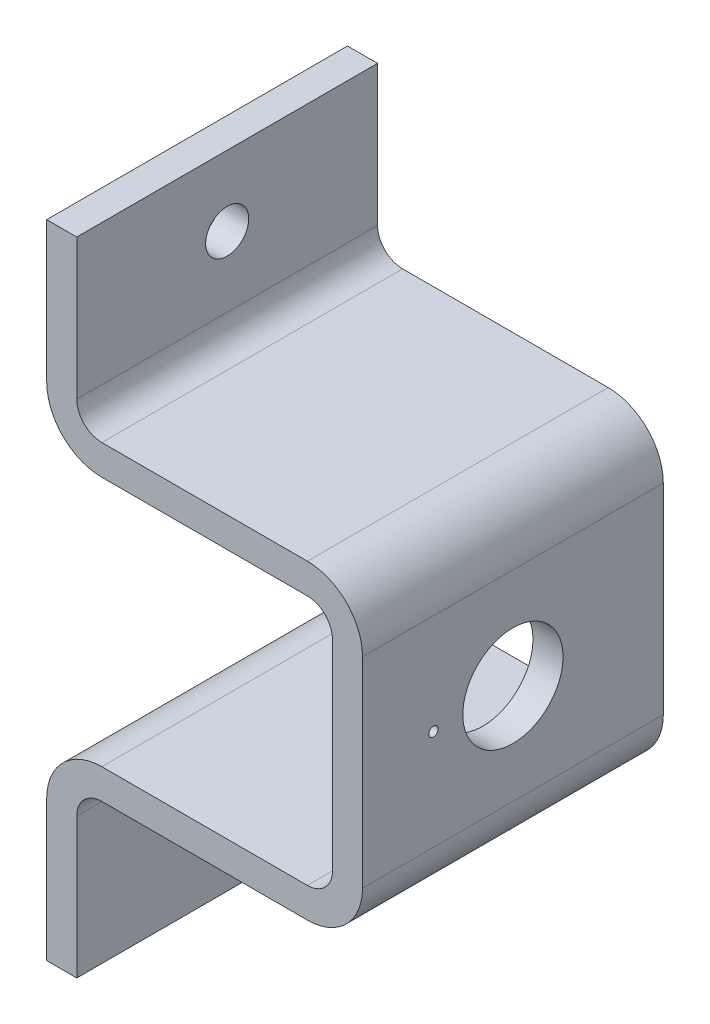
ISO-10303-21;
HEADER;
FILE_DESCRIPTION(('STEP AP214'),'2;1');
FILE_NAME('part.step','',(''),(''),'','','');
FILE_SCHEMA(('AUTOMOTIVE_DESIGN { 1 0 10303 214 1 1 1 1 }'));
ENDSEC;
DATA;
#1=APPLICATION_CONTEXT('core data for automotive mechanical design processes');
#2=APPLICATION_PROTOCOL_DEFINITION('international standard','automotive_design',2000,#1);
#3=PRODUCT_CONTEXT('',#1,'mechanical');
#4=PRODUCT('Part','Part','',(#3));
#5=PRODUCT_RELATED_PRODUCT_CATEGORY('part','',(#4));
#6=PRODUCT_DEFINITION_FORMATION('','',#4);
#7=PRODUCT_DEFINITION_CONTEXT('part definition',#1,'design');
#8=PRODUCT_DEFINITION('design','',#6,#7);
#9=PRODUCT_DEFINITION_SHAPE('','',#8);
#10=(LENGTH_UNIT() NAMED_UNIT(*) SI_UNIT(.MILLI.,.METRE.));
#11=(NAMED_UNIT(*) PLANE_ANGLE_UNIT() SI_UNIT($,.RADIAN.));
#12=(NAMED_UNIT(*) SI_UNIT($,.STERADIAN.) SOLID_ANGLE_UNIT());
#13=UNCERTAINTY_MEASURE_WITH_UNIT(LENGTH_MEASURE(1.E-05),#10,'distance_accuracy_value','');
#14=(GEOMETRIC_REPRESENTATION_CONTEXT(3) GLOBAL_UNCERTAINTY_ASSIGNED_CONTEXT((#13)) GLOBAL_UNIT_ASSIGNED_CONTEXT((#10,
#11,#12)) REPRESENTATION_CONTEXT('',''));
#15=CARTESIAN_POINT('',(0.,0.,0.));
#16=DIRECTION('',(0.,0.,1.));
#17=DIRECTION('',(1.,0.,0.));
#18=AXIS2_PLACEMENT_3D('',#15,#16,#17);
#19=CARTESIAN_POINT('',(3.,0.,30.));
#20=DIRECTION('',(0.,1.,0.));
#21=DIRECTION('',(0.,0.,1.));
#22=AXIS2_PLACEMENT_3D('',#19,#20,#21);
#23=PLANE('',#22);
#24=DIRECTION('',(1.,0.,0.));
#25=VECTOR('',#24,1.);
#26=CARTESIAN_POINT('',(3.,0.,0.));
#27=LINE('',#26,#25);
#28=CARTESIAN_POINT('',(0.,0.,0.));
#29=VERTEX_POINT('',#28);
#30=CARTESIAN_POINT('',(3.,0.,0.));
#31=VERTEX_POINT('',#30);
#32=EDGE_CURVE('E206',#29,#31,#27,.T.);
#33=ORIENTED_EDGE('',*,*,#32,.T.);
#34=DIRECTION('',(0.,0.,-1.));
#35=VECTOR('',#34,1.);
#36=CARTESIAN_POINT('',(3.,0.,30.));
#37=LINE('',#36,#35);
#38=CARTESIAN_POINT('',(3.,0.,30.));
#39=VERTEX_POINT('',#38);
#40=EDGE_CURVE('E11',#39,#31,#37,.T.);
#41=ORIENTED_EDGE('',*,*,#40,.F.);
#42=DIRECTION('',(1.,0.,0.));
#43=VECTOR('',#42,1.);
#44=CARTESIAN_POINT('',(3.,0.,30.));
#45=LINE('',#44,#43);
#46=CARTESIAN_POINT('',(0.,0.,30.));
#47=VERTEX_POINT('',#46);
#48=EDGE_CURVE('E245',#47,#39,#45,.T.);
#49=ORIENTED_EDGE('',*,*,#48,.F.);
#50=DIRECTION('',(0.,0.,-1.));
#51=VECTOR('',#50,1.);
#52=CARTESIAN_POINT('',(0.,0.,30.));
#53=LINE('',#52,#51);
#54=EDGE_CURVE('E202',#47,#29,#53,.T.);
#55=ORIENTED_EDGE('',*,*,#54,.T.);
#56=EDGE_LOOP('',(#33,#41,#49,#55));
#57=FACE_BOUND('',#56,.T.);
#58=ADVANCED_FACE('F36',(#57),#23,.F.);
#59=CARTESIAN_POINT('',(3.,0.,30.));
#60=DIRECTION('',(-1.,0.,0.));
#61=DIRECTION('',(0.,-1.,0.));
#62=AXIS2_PLACEMENT_3D('',#59,#60,#61);
#63=PLANE('',#62);
#64=CARTESIAN_POINT('',(3.,7.,15.));
#65=DIRECTION('',(1.,0.,0.));
#66=DIRECTION('',(0.,0.,-1.));
#67=AXIS2_PLACEMENT_3D('',#64,#65,#66);
#68=CIRCLE('',#67,2.14999999999999);
#69=CARTESIAN_POINT('',(3.,7.,12.85));
#70=VERTEX_POINT('',#69);
#71=EDGE_CURVE('E294',#70,#70,#68,.T.);
#72=ORIENTED_EDGE('',*,*,#71,.F.);
#73=EDGE_LOOP('',(#72));
#74=FACE_BOUND('',#73,.T.);
#75=DIRECTION('',(0.,1.,0.));
#76=VECTOR('',#75,1.);
#77=CARTESIAN_POINT('',(3.,0.,0.));
#78=LINE('',#77,#76);
#79=CARTESIAN_POINT('',(3.00000000000006,14.,0.));
#80=VERTEX_POINT('',#79);
#81=EDGE_CURVE('E209',#31,#80,#78,.T.);
#82=ORIENTED_EDGE('',*,*,#81,.T.);
#83=DIRECTION('',(0.,0.,-1.));
#84=VECTOR('',#83,1.);
#85=CARTESIAN_POINT('',(3.00000000000006,14.,30.));
#86=LINE('',#85,#84);
#87=CARTESIAN_POINT('',(3.00000000000006,14.,30.));
#88=VERTEX_POINT('',#87);
#89=EDGE_CURVE('E45',#88,#80,#86,.T.);
#90=ORIENTED_EDGE('',*,*,#89,.F.);
#91=DIRECTION('',(0.,1.,0.));
#92=VECTOR('',#91,1.);
#93=CARTESIAN_POINT('',(3.,0.,30.));
#94=LINE('',#93,#92);
#95=EDGE_CURVE('E133',#39,#88,#94,.T.);
#96=ORIENTED_EDGE('',*,*,#95,.F.);
#97=ORIENTED_EDGE('',*,*,#40,.T.);
#98=EDGE_LOOP('',(#82,#90,#96,#97));
#99=FACE_BOUND('',#98,.T.);
#100=ADVANCED_FACE('F370',(#74,#99),#63,.F.);
#101=CARTESIAN_POINT('',(5.50000000000006,14.,30.));
#102=DIRECTION('',(0.,0.,-1.));
#103=DIRECTION('',(-1.,0.,0.));
#104=AXIS2_PLACEMENT_3D('',#101,#102,#103);
#105=CYLINDRICAL_SURFACE('',#104,2.5);
#106=CARTESIAN_POINT('',(5.50000000000006,14.,0.));
#107=DIRECTION('',(0.,0.,-1.));
#108=DIRECTION('',(-1.,0.,0.));
#109=AXIS2_PLACEMENT_3D('',#106,#107,#108);
#110=CIRCLE('',#109,2.5);
#111=CARTESIAN_POINT('',(5.50000000000006,16.5,0.));
#112=VERTEX_POINT('',#111);
#113=EDGE_CURVE('E212',#80,#112,#110,.T.);
#114=ORIENTED_EDGE('',*,*,#113,.T.);
#115=DIRECTION('',(0.,0.,-1.));
#116=VECTOR('',#115,1.);
#117=CARTESIAN_POINT('',(5.50000000000006,16.5,30.));
#118=LINE('',#117,#116);
#119=CARTESIAN_POINT('',(5.50000000000006,16.5,30.));
#120=VERTEX_POINT('',#119);
#121=EDGE_CURVE('E288',#120,#112,#118,.T.);
#122=ORIENTED_EDGE('',*,*,#121,.F.);
#123=CARTESIAN_POINT('',(5.50000000000006,14.,30.));
#124=DIRECTION('',(0.,0.,-1.));
#125=DIRECTION('',(-1.,0.,0.));
#126=AXIS2_PLACEMENT_3D('',#123,#124,#125);
#127=CIRCLE('',#126,2.5);
#128=EDGE_CURVE('E314',#88,#120,#127,.T.);
#129=ORIENTED_EDGE('',*,*,#128,.F.);
#130=ORIENTED_EDGE('',*,*,#89,.T.);
#131=EDGE_LOOP('',(#114,#122,#129,#130));
#132=FACE_BOUND('',#131,.T.);
#133=ADVANCED_FACE('F374',(#132),#105,.F.);
#134=CARTESIAN_POINT('',(5.50000000000006,16.5,30.));
#135=DIRECTION('',(0.,1.,0.));
#136=DIRECTION('',(-1.,0.,0.));
#137=AXIS2_PLACEMENT_3D('',#134,#135,#136);
#138=PLANE('',#137);
#139=DIRECTION('',(1.,0.,0.));
#140=VECTOR('',#139,1.);
#141=CARTESIAN_POINT('',(5.50000000000006,16.5,0.));
#142=LINE('',#141,#140);
#143=CARTESIAN_POINT('',(26.0000000000001,16.5,0.));
#144=VERTEX_POINT('',#143);
#145=EDGE_CURVE('E214',#112,#144,#142,.T.);
#146=ORIENTED_EDGE('',*,*,#145,.T.);
#147=DIRECTION('',(0.,0.,-1.));
#148=VECTOR('',#147,1.);
#149=CARTESIAN_POINT('',(26.0000000000001,16.5,30.));
#150=LINE('',#149,#148);
#151=CARTESIAN_POINT('',(26.0000000000001,16.5,30.));
#152=VERTEX_POINT('',#151);
#153=EDGE_CURVE('E285',#152,#144,#150,.T.);
#154=ORIENTED_EDGE('',*,*,#153,.F.);
#155=DIRECTION('',(1.,0.,0.));
#156=VECTOR('',#155,1.);
#157=CARTESIAN_POINT('',(5.50000000000006,16.5,30.));
#158=LINE('',#157,#156);
#159=EDGE_CURVE('E316',#120,#152,#158,.T.);
#160=ORIENTED_EDGE('',*,*,#159,.F.);
#161=ORIENTED_EDGE('',*,*,#121,.T.);
#162=EDGE_LOOP('',(#146,#154,#160,#161));
#163=FACE_BOUND('',#162,.T.);
#164=ADVANCED_FACE('F379',(#163),#138,.F.);
#165=CARTESIAN_POINT('',(26.0000000000001,22.,30.));
#166=DIRECTION('',(0.,0.,-1.));
#167=DIRECTION('',(-1.,0.,0.));
#168=AXIS2_PLACEMENT_3D('',#165,#166,#167);
#169=CYLINDRICAL_SURFACE('',#168,5.5);
#170=CARTESIAN_POINT('',(26.0000000000001,22.,0.));
#171=DIRECTION('',(0.,0.,1.));
#172=DIRECTION('',(1.,0.,0.));
#173=AXIS2_PLACEMENT_3D('',#170,#171,#172);
#174=CIRCLE('',#173,5.5);
#175=CARTESIAN_POINT('',(31.5000000000001,22.,0.));
#176=VERTEX_POINT('',#175);
#177=EDGE_CURVE('E216',#144,#176,#174,.T.);
#178=ORIENTED_EDGE('',*,*,#177,.T.);
#179=DIRECTION('',(0.,0.,-1.));
#180=VECTOR('',#179,1.);
#181=CARTESIAN_POINT('',(31.5000000000001,22.,30.));
#182=LINE('',#181,#180);
#183=CARTESIAN_POINT('',(31.5000000000001,22.,30.));
#184=VERTEX_POINT('',#183);
#185=EDGE_CURVE('E282',#184,#176,#182,.T.);
#186=ORIENTED_EDGE('',*,*,#185,.F.);
#187=CARTESIAN_POINT('',(26.0000000000001,22.,30.));
#188=DIRECTION('',(0.,0.,1.));
#189=DIRECTION('',(1.,0.,0.));
#190=AXIS2_PLACEMENT_3D('',#187,#188,#189);
#191=CIRCLE('',#190,5.5);
#192=EDGE_CURVE('E318',#152,#184,#191,.T.);
#193=ORIENTED_EDGE('',*,*,#192,.F.);
#194=ORIENTED_EDGE('',*,*,#153,.T.);
#195=EDGE_LOOP('',(#178,#186,#193,#194));
#196=FACE_BOUND('',#195,.T.);
#197=ADVANCED_FACE('F386',(#196),#169,.T.);
#198=CARTESIAN_POINT('',(31.5000000000001,22.,30.));
#199=DIRECTION('',(-1.,0.,0.));
#200=DIRECTION('',(0.,0.,1.));
#201=AXIS2_PLACEMENT_3D('',#198,#199,#200);
#202=PLANE('',#201);
#203=CARTESIAN_POINT('',(31.5000000000001,32.,22.92));
#204=DIRECTION('',(1.,0.,0.));
#205=DIRECTION('',(0.,0.,-1.));
#206=AXIS2_PLACEMENT_3D('',#203,#204,#205);
#207=CIRCLE('',#206,0.475000000000001);
#208=CARTESIAN_POINT('',(31.5000000000001,32.,22.445));
#209=VERTEX_POINT('',#208);
#210=EDGE_CURVE('E545',#209,#209,#207,.T.);
#211=ORIENTED_EDGE('',*,*,#210,.F.);
#212=EDGE_LOOP('',(#211));
#213=FACE_BOUND('',#212,.T.);
#214=CARTESIAN_POINT('',(31.5000000000001,32.,15.));
#215=DIRECTION('',(1.,0.,0.));
#216=DIRECTION('',(0.,0.,-1.));
#217=AXIS2_PLACEMENT_3D('',#214,#215,#216);
#218=CIRCLE('',#217,5.);
#219=CARTESIAN_POINT('',(31.5000000000001,32.,10.));
#220=VERTEX_POINT('',#219);
#221=EDGE_CURVE('E308',#220,#220,#218,.T.);
#222=ORIENTED_EDGE('',*,*,#221,.F.);
#223=EDGE_LOOP('',(#222));
#224=FACE_BOUND('',#223,.T.);
#225=DIRECTION('',(0.,1.,0.));
#226=VECTOR('',#225,1.);
#227=CARTESIAN_POINT('',(31.5000000000001,22.,0.));
#228=LINE('',#227,#226);
#229=CARTESIAN_POINT('',(31.5000000000001,42.,0.));
#230=VERTEX_POINT('',#229);
#231=EDGE_CURVE('E218',#176,#230,#228,.T.);
#232=ORIENTED_EDGE('',*,*,#231,.T.);
#233=DIRECTION('',(0.,0.,-1.));
#234=VECTOR('',#233,1.);
#235=CARTESIAN_POINT('',(31.5000000000001,42.,30.));
#236=LINE('',#235,#234);
#237=CARTESIAN_POINT('',(31.5000000000001,42.,30.));
#238=VERTEX_POINT('',#237);
#239=EDGE_CURVE('E279',#238,#230,#236,.T.);
#240=ORIENTED_EDGE('',*,*,#239,.F.);
#241=DIRECTION('',(0.,1.,0.));
#242=VECTOR('',#241,1.);
#243=CARTESIAN_POINT('',(31.5000000000001,22.,30.));
#244=LINE('',#243,#242);
#245=EDGE_CURVE('E320',#184,#238,#244,.T.);
#246=ORIENTED_EDGE('',*,*,#245,.F.);
#247=ORIENTED_EDGE('',*,*,#185,.T.);
#248=EDGE_LOOP('',(#232,#240,#246,#247));
#249=FACE_BOUND('',#248,.T.);
#250=ADVANCED_FACE('F390',(#213,#224,#249),#202,.F.);
#251=CARTESIAN_POINT('',(26.0000000000001,42.,30.));
#252=DIRECTION('',(0.,0.,-1.));
#253=DIRECTION('',(-1.,0.,0.));
#254=AXIS2_PLACEMENT_3D('',#251,#252,#253);
#255=CYLINDRICAL_SURFACE('',#254,5.5);
#256=CARTESIAN_POINT('',(26.0000000000001,42.,0.));
#257=DIRECTION('',(0.,0.,1.));
#258=DIRECTION('',(1.,0.,0.));
#259=AXIS2_PLACEMENT_3D('',#256,#257,#258);
#260=CIRCLE('',#259,5.5);
#261=CARTESIAN_POINT('',(26.0000000000001,47.5,0.));
#262=VERTEX_POINT('',#261);
#263=EDGE_CURVE('E220',#230,#262,#260,.T.);
#264=ORIENTED_EDGE('',*,*,#263,.T.);
#265=DIRECTION('',(0.,0.,-1.));
#266=VECTOR('',#265,1.);
#267=CARTESIAN_POINT('',(26.0000000000001,47.5,30.));
#268=LINE('',#267,#266);
#269=CARTESIAN_POINT('',(26.0000000000001,47.5,30.));
#270=VERTEX_POINT('',#269);
#271=EDGE_CURVE('E276',#270,#262,#268,.T.);
#272=ORIENTED_EDGE('',*,*,#271,.F.);
#273=CARTESIAN_POINT('',(26.0000000000001,42.,30.));
#274=DIRECTION('',(0.,0.,1.));
#275=DIRECTION('',(1.,0.,0.));
#276=AXIS2_PLACEMENT_3D('',#273,#274,#275);
#277=CIRCLE('',#276,5.5);
#278=EDGE_CURVE('E322',#238,#270,#277,.T.);
#279=ORIENTED_EDGE('',*,*,#278,.F.);
#280=ORIENTED_EDGE('',*,*,#239,.T.);
#281=EDGE_LOOP('',(#264,#272,#279,#280));
#282=FACE_BOUND('',#281,.T.);
#283=ADVANCED_FACE('F394',(#282),#255,.T.);
#284=CARTESIAN_POINT('',(26.0000000000001,47.5,30.));
#285=DIRECTION('',(0.,-1.,0.));
#286=DIRECTION('',(1.,0.,0.));
#287=AXIS2_PLACEMENT_3D('',#284,#285,#286);
#288=PLANE('',#287);
#289=DIRECTION('',(-1.,0.,0.));
#290=VECTOR('',#289,1.);
#291=CARTESIAN_POINT('',(26.0000000000001,47.5,0.));
#292=LINE('',#291,#290);
#293=CARTESIAN_POINT('',(5.5,47.5,0.));
#294=VERTEX_POINT('',#293);
#295=EDGE_CURVE('E222',#262,#294,#292,.T.);
#296=ORIENTED_EDGE('',*,*,#295,.T.);
#297=DIRECTION('',(0.,0.,-1.));
#298=VECTOR('',#297,1.);
#299=CARTESIAN_POINT('',(5.5,47.5,30.));
#300=LINE('',#299,#298);
#301=CARTESIAN_POINT('',(5.5,47.5,30.));
#302=VERTEX_POINT('',#301);
#303=EDGE_CURVE('E273',#302,#294,#300,.T.);
#304=ORIENTED_EDGE('',*,*,#303,.F.);
#305=DIRECTION('',(-1.,0.,0.));
#306=VECTOR('',#305,1.);
#307=CARTESIAN_POINT('',(26.0000000000001,47.5,30.));
#308=LINE('',#307,#306);
#309=EDGE_CURVE('E324',#270,#302,#308,.T.);
#310=ORIENTED_EDGE('',*,*,#309,.F.);
#311=ORIENTED_EDGE('',*,*,#271,.T.);
#312=EDGE_LOOP('',(#296,#304,#310,#311));
#313=FACE_BOUND('',#312,.T.);
#314=ADVANCED_FACE('F398',(#313),#288,.F.);
#315=CARTESIAN_POINT('',(5.49999999999999,50.,30.));
#316=DIRECTION('',(0.,0.,-1.));
#317=DIRECTION('',(-1.,0.,0.));
#318=AXIS2_PLACEMENT_3D('',#315,#316,#317);
#319=CYLINDRICAL_SURFACE('',#318,2.49999999999999);
#320=CARTESIAN_POINT('',(5.49999999999999,50.,0.));
#321=DIRECTION('',(0.,0.,-1.));
#322=DIRECTION('',(-1.,0.,0.));
#323=AXIS2_PLACEMENT_3D('',#320,#321,#322);
#324=CIRCLE('',#323,2.49999999999999);
#325=CARTESIAN_POINT('',(3.,50.,0.));
#326=VERTEX_POINT('',#325);
#327=EDGE_CURVE('E224',#294,#326,#324,.T.);
#328=ORIENTED_EDGE('',*,*,#327,.T.);
#329=DIRECTION('',(0.,0.,-1.));
#330=VECTOR('',#329,1.);
#331=CARTESIAN_POINT('',(3.,50.,30.));
#332=LINE('',#331,#330);
#333=CARTESIAN_POINT('',(3.,50.,30.));
#334=VERTEX_POINT('',#333);
#335=EDGE_CURVE('E270',#334,#326,#332,.T.);
#336=ORIENTED_EDGE('',*,*,#335,.F.);
#337=CARTESIAN_POINT('',(5.49999999999999,50.,30.));
#338=DIRECTION('',(0.,0.,-1.));
#339=DIRECTION('',(-1.,0.,0.));
#340=AXIS2_PLACEMENT_3D('',#337,#338,#339);
#341=CIRCLE('',#340,2.49999999999999);
#342=EDGE_CURVE('E326',#302,#334,#341,.T.);
#343=ORIENTED_EDGE('',*,*,#342,.F.);
#344=ORIENTED_EDGE('',*,*,#303,.T.);
#345=EDGE_LOOP('',(#328,#336,#343,#344));
#346=FACE_BOUND('',#345,.T.);
#347=ADVANCED_FACE('F402',(#346),#319,.F.);
#348=CARTESIAN_POINT('',(3.,50.,30.));
#349=DIRECTION('',(-1.,0.,0.));
#350=DIRECTION('',(0.,0.,1.));
#351=AXIS2_PLACEMENT_3D('',#348,#349,#350);
#352=PLANE('',#351);
#353=CARTESIAN_POINT('',(3.,57.,15.));
#354=DIRECTION('',(1.,0.,0.));
#355=DIRECTION('',(0.,0.,-1.));
#356=AXIS2_PLACEMENT_3D('',#353,#354,#355);
#357=CIRCLE('',#356,2.14999999999999);
#358=CARTESIAN_POINT('',(3.,57.,12.85));
#359=VERTEX_POINT('',#358);
#360=EDGE_CURVE('E297',#359,#359,#357,.T.);
#361=ORIENTED_EDGE('',*,*,#360,.F.);
#362=EDGE_LOOP('',(#361));
#363=FACE_BOUND('',#362,.T.);
#364=DIRECTION('',(0.,1.,0.));
#365=VECTOR('',#364,1.);
#366=CARTESIAN_POINT('',(3.,50.,0.));
#367=LINE('',#366,#365);
#368=CARTESIAN_POINT('',(3.,64.,0.));
#369=VERTEX_POINT('',#368);
#370=EDGE_CURVE('E226',#326,#369,#367,.T.);
#371=ORIENTED_EDGE('',*,*,#370,.T.);
#372=DIRECTION('',(0.,0.,-1.));
#373=VECTOR('',#372,1.);
#374=CARTESIAN_POINT('',(3.,64.,30.));
#375=LINE('',#374,#373);
#376=CARTESIAN_POINT('',(3.,64.,30.));
#377=VERTEX_POINT('',#376);
#378=EDGE_CURVE('E267',#377,#369,#375,.T.);
#379=ORIENTED_EDGE('',*,*,#378,.F.);
#380=DIRECTION('',(0.,1.,0.));
#381=VECTOR('',#380,1.);
#382=CARTESIAN_POINT('',(3.,50.,30.));
#383=LINE('',#382,#381);
#384=EDGE_CURVE('E328',#334,#377,#383,.T.);
#385=ORIENTED_EDGE('',*,*,#384,.F.);
#386=ORIENTED_EDGE('',*,*,#335,.T.);
#387=EDGE_LOOP('',(#371,#379,#385,#386));
#388=FACE_BOUND('',#387,.T.);
#389=ADVANCED_FACE('F406',(#363,#388),#352,.F.);
#390=CARTESIAN_POINT('',(0.,64.,30.));
#391=DIRECTION('',(0.,-1.,0.));
#392=DIRECTION('',(0.,0.,-1.));
#393=AXIS2_PLACEMENT_3D('',#390,#391,#392);
#394=PLANE('',#393);
#395=DIRECTION('',(-1.,0.,0.));
#396=VECTOR('',#395,1.);
#397=CARTESIAN_POINT('',(0.,64.,0.));
#398=LINE('',#397,#396);
#399=CARTESIAN_POINT('',(0.,64.,0.));
#400=VERTEX_POINT('',#399);
#401=EDGE_CURVE('E228',#369,#400,#398,.T.);
#402=ORIENTED_EDGE('',*,*,#401,.T.);
#403=DIRECTION('',(0.,0.,-1.));
#404=VECTOR('',#403,1.);
#405=CARTESIAN_POINT('',(0.,64.,30.));
#406=LINE('',#405,#404);
#407=CARTESIAN_POINT('',(0.,64.,30.));
#408=VERTEX_POINT('',#407);
#409=EDGE_CURVE('E264',#408,#400,#406,.T.);
#410=ORIENTED_EDGE('',*,*,#409,.F.);
#411=DIRECTION('',(-1.,0.,0.));
#412=VECTOR('',#411,1.);
#413=CARTESIAN_POINT('',(0.,64.,30.));
#414=LINE('',#413,#412);
#415=EDGE_CURVE('E330',#377,#408,#414,.T.);
#416=ORIENTED_EDGE('',*,*,#415,.F.);
#417=ORIENTED_EDGE('',*,*,#378,.T.);
#418=EDGE_LOOP('',(#402,#410,#416,#417));
#419=FACE_BOUND('',#418,.T.);
#420=ADVANCED_FACE('F410',(#419),#394,.F.);
#421=CARTESIAN_POINT('',(0.,50.,30.));
#422=DIRECTION('',(1.,0.,0.));
#423=DIRECTION('',(0.,0.,-1.));
#424=AXIS2_PLACEMENT_3D('',#421,#422,#423);
#425=PLANE('',#424);
#426=CARTESIAN_POINT('',(0.,57.,15.));
#427=DIRECTION('',(1.,0.,0.));
#428=DIRECTION('',(0.,0.,-1.));
#429=AXIS2_PLACEMENT_3D('',#426,#427,#428);
#430=CIRCLE('',#429,2.14999999999999);
#431=CARTESIAN_POINT('',(0.,57.,12.85));
#432=VERTEX_POINT('',#431);
#433=EDGE_CURVE('E295',#432,#432,#430,.T.);
#434=ORIENTED_EDGE('',*,*,#433,.T.);
#435=EDGE_LOOP('',(#434));
#436=FACE_BOUND('',#435,.T.);
#437=DIRECTION('',(0.,-1.,0.));
#438=VECTOR('',#437,1.);
#439=CARTESIAN_POINT('',(0.,50.,0.));
#440=LINE('',#439,#438);
#441=CARTESIAN_POINT('',(0.,50.,0.));
#442=VERTEX_POINT('',#441);
#443=EDGE_CURVE('E230',#400,#442,#440,.T.);
#444=ORIENTED_EDGE('',*,*,#443,.T.);
#445=DIRECTION('',(0.,0.,-1.));
#446=VECTOR('',#445,1.);
#447=CARTESIAN_POINT('',(0.,50.,30.));
#448=LINE('',#447,#446);
#449=CARTESIAN_POINT('',(0.,50.,30.));
#450=VERTEX_POINT('',#449);
#451=EDGE_CURVE('E261',#450,#442,#448,.T.);
#452=ORIENTED_EDGE('',*,*,#451,.F.);
#453=DIRECTION('',(0.,-1.,0.));
#454=VECTOR('',#453,1.);
#455=CARTESIAN_POINT('',(0.,50.,30.));
#456=LINE('',#455,#454);
#457=EDGE_CURVE('E332',#408,#450,#456,.T.);
#458=ORIENTED_EDGE('',*,*,#457,.F.);
#459=ORIENTED_EDGE('',*,*,#409,.T.);
#460=EDGE_LOOP('',(#444,#452,#458,#459));
#461=FACE_BOUND('',#460,.T.);
#462=ADVANCED_FACE('F414',(#436,#461),#425,.F.);
#463=CARTESIAN_POINT('',(5.49999999999999,50.,30.));
#464=DIRECTION('',(0.,0.,-1.));
#465=DIRECTION('',(-1.,0.,0.));
#466=AXIS2_PLACEMENT_3D('',#463,#464,#465);
#467=CYLINDRICAL_SURFACE('',#466,5.5);
#468=CARTESIAN_POINT('',(5.49999999999999,50.,0.));
#469=DIRECTION('',(0.,0.,1.));
#470=DIRECTION('',(-1.,0.,0.));
#471=AXIS2_PLACEMENT_3D('',#468,#469,#470);
#472=CIRCLE('',#471,5.5);
#473=CARTESIAN_POINT('',(5.5,44.5,0.));
#474=VERTEX_POINT('',#473);
#475=EDGE_CURVE('E232',#442,#474,#472,.T.);
#476=ORIENTED_EDGE('',*,*,#475,.T.);
#477=DIRECTION('',(0.,0.,-1.));
#478=VECTOR('',#477,1.);
#479=CARTESIAN_POINT('',(5.5,44.5,30.));
#480=LINE('',#479,#478);
#481=CARTESIAN_POINT('',(5.5,44.5,30.));
#482=VERTEX_POINT('',#481);
#483=EDGE_CURVE('E258',#482,#474,#480,.T.);
#484=ORIENTED_EDGE('',*,*,#483,.F.);
#485=CARTESIAN_POINT('',(5.49999999999999,50.,30.));
#486=DIRECTION('',(0.,0.,1.));
#487=DIRECTION('',(-1.,0.,0.));
#488=AXIS2_PLACEMENT_3D('',#485,#486,#487);
#489=CIRCLE('',#488,5.5);
#490=EDGE_CURVE('E334',#450,#482,#489,.T.);
#491=ORIENTED_EDGE('',*,*,#490,.F.);
#492=ORIENTED_EDGE('',*,*,#451,.T.);
#493=EDGE_LOOP('',(#476,#484,#491,#492));
#494=FACE_BOUND('',#493,.T.);
#495=ADVANCED_FACE('F418',(#494),#467,.T.);
#496=CARTESIAN_POINT('',(26.0000000000001,44.5,30.));
#497=DIRECTION('',(0.,1.,0.));
#498=DIRECTION('',(-1.,0.,0.));
#499=AXIS2_PLACEMENT_3D('',#496,#497,#498);
#500=PLANE('',#499);
#501=DIRECTION('',(1.,0.,0.));
#502=VECTOR('',#501,1.);
#503=CARTESIAN_POINT('',(26.0000000000001,44.5,0.));
#504=LINE('',#503,#502);
#505=CARTESIAN_POINT('',(26.0000000000001,44.5,0.));
#506=VERTEX_POINT('',#505);
#507=EDGE_CURVE('E234',#474,#506,#504,.T.);
#508=ORIENTED_EDGE('',*,*,#507,.T.);
#509=DIRECTION('',(0.,0.,-1.));
#510=VECTOR('',#509,1.);
#511=CARTESIAN_POINT('',(26.0000000000001,44.5,30.));
#512=LINE('',#511,#510);
#513=CARTESIAN_POINT('',(26.0000000000001,44.5,30.));
#514=VERTEX_POINT('',#513);
#515=EDGE_CURVE('E255',#514,#506,#512,.T.);
#516=ORIENTED_EDGE('',*,*,#515,.F.);
#517=DIRECTION('',(1.,0.,0.));
#518=VECTOR('',#517,1.);
#519=CARTESIAN_POINT('',(26.0000000000001,44.5,30.));
#520=LINE('',#519,#518);
#521=EDGE_CURVE('E336',#482,#514,#520,.T.);
#522=ORIENTED_EDGE('',*,*,#521,.F.);
#523=ORIENTED_EDGE('',*,*,#483,.T.);
#524=EDGE_LOOP('',(#508,#516,#522,#523));
#525=FACE_BOUND('',#524,.T.);
#526=ADVANCED_FACE('F421',(#525),#500,.F.);
#527=CARTESIAN_POINT('',(26.0000000000001,42.,30.));
#528=DIRECTION('',(0.,0.,-1.));
#529=DIRECTION('',(-1.,0.,0.));
#530=AXIS2_PLACEMENT_3D('',#527,#528,#529);
#531=CYLINDRICAL_SURFACE('',#530,2.49999999999999);
#532=CARTESIAN_POINT('',(26.0000000000001,42.,0.));
#533=DIRECTION('',(0.,0.,-1.));
#534=DIRECTION('',(1.,0.,0.));
#535=AXIS2_PLACEMENT_3D('',#532,#533,#534);
#536=CIRCLE('',#535,2.49999999999999);
#537=CARTESIAN_POINT('',(28.5000000000001,42.,0.));
#538=VERTEX_POINT('',#537);
#539=EDGE_CURVE('E236',#506,#538,#536,.T.);
#540=ORIENTED_EDGE('',*,*,#539,.T.);
#541=DIRECTION('',(0.,0.,-1.));
#542=VECTOR('',#541,1.);
#543=CARTESIAN_POINT('',(28.5000000000001,42.,30.));
#544=LINE('',#543,#542);
#545=CARTESIAN_POINT('',(28.5000000000001,42.,30.));
#546=VERTEX_POINT('',#545);
#547=EDGE_CURVE('E252',#546,#538,#544,.T.);
#548=ORIENTED_EDGE('',*,*,#547,.F.);
#549=CARTESIAN_POINT('',(26.0000000000001,42.,30.));
#550=DIRECTION('',(0.,0.,-1.));
#551=DIRECTION('',(1.,0.,0.));
#552=AXIS2_PLACEMENT_3D('',#549,#550,#551);
#553=CIRCLE('',#552,2.49999999999999);
#554=EDGE_CURVE('E338',#514,#546,#553,.T.);
#555=ORIENTED_EDGE('',*,*,#554,.F.);
#556=ORIENTED_EDGE('',*,*,#515,.T.);
#557=EDGE_LOOP('',(#540,#548,#555,#556));
#558=FACE_BOUND('',#557,.T.);
#559=ADVANCED_FACE('F425',(#558),#531,.F.);
#560=CARTESIAN_POINT('',(28.5000000000001,22.,30.));
#561=DIRECTION('',(1.,0.,0.));
#562=DIRECTION('',(0.,1.,0.));
#563=AXIS2_PLACEMENT_3D('',#560,#561,#562);
#564=PLANE('',#563);
#565=CARTESIAN_POINT('',(28.5000000000001,32.,22.92));
#566=DIRECTION('',(1.,0.,0.));
#567=DIRECTION('',(0.,1.,0.));
#568=AXIS2_PLACEMENT_3D('',#565,#566,#567);
#569=CIRCLE('',#568,0.475000000000001);
#570=CARTESIAN_POINT('',(28.5000000000001,32.475,22.92));
#571=VERTEX_POINT('',#570);
#572=EDGE_CURVE('E39',#571,#571,#569,.T.);
#573=ORIENTED_EDGE('',*,*,#572,.T.);
#574=EDGE_LOOP('',(#573));
#575=FACE_BOUND('',#574,.T.);
#576=CARTESIAN_POINT('',(28.5000000000001,32.,15.));
#577=DIRECTION('',(1.,0.,0.));
#578=DIRECTION('',(0.,1.,0.));
#579=AXIS2_PLACEMENT_3D('',#576,#577,#578);
#580=CIRCLE('',#579,5.);
#581=CARTESIAN_POINT('',(28.5000000000001,37.,15.));
#582=VERTEX_POINT('',#581);
#583=EDGE_CURVE('E303',#582,#582,#580,.T.);
#584=ORIENTED_EDGE('',*,*,#583,.T.);
#585=EDGE_LOOP('',(#584));
#586=FACE_BOUND('',#585,.T.);
#587=DIRECTION('',(0.,-1.,0.));
#588=VECTOR('',#587,1.);
#589=CARTESIAN_POINT('',(28.5000000000001,22.,0.));
#590=LINE('',#589,#588);
#591=CARTESIAN_POINT('',(28.5000000000001,22.,0.));
#592=VERTEX_POINT('',#591);
#593=EDGE_CURVE('E238',#538,#592,#590,.T.);
#594=ORIENTED_EDGE('',*,*,#593,.T.);
#595=DIRECTION('',(0.,0.,-1.));
#596=VECTOR('',#595,1.);
#597=CARTESIAN_POINT('',(28.5000000000001,22.,30.));
#598=LINE('',#597,#596);
#599=CARTESIAN_POINT('',(28.5000000000001,22.,30.));
#600=VERTEX_POINT('',#599);
#601=EDGE_CURVE('E249',#600,#592,#598,.T.);
#602=ORIENTED_EDGE('',*,*,#601,.F.);
#603=DIRECTION('',(0.,-1.,0.));
#604=VECTOR('',#603,1.);
#605=CARTESIAN_POINT('',(28.5000000000001,22.,30.));
#606=LINE('',#605,#604);
#607=EDGE_CURVE('E340',#546,#600,#606,.T.);
#608=ORIENTED_EDGE('',*,*,#607,.F.);
#609=ORIENTED_EDGE('',*,*,#547,.T.);
#610=EDGE_LOOP('',(#594,#602,#608,#609));
#611=FACE_BOUND('',#610,.T.);
#612=ADVANCED_FACE('F346',(#575,#586,#611),#564,.F.);
#613=CARTESIAN_POINT('',(26.0000000000001,22.,30.));
#614=DIRECTION('',(0.,0.,-1.));
#615=DIRECTION('',(-1.,0.,0.));
#616=AXIS2_PLACEMENT_3D('',#613,#614,#615);
#617=CYLINDRICAL_SURFACE('',#616,2.5);
#618=CARTESIAN_POINT('',(26.0000000000001,22.,0.));
#619=DIRECTION('',(0.,0.,-1.));
#620=DIRECTION('',(1.,0.,0.));
#621=AXIS2_PLACEMENT_3D('',#618,#619,#620);
#622=CIRCLE('',#621,2.5);
#623=CARTESIAN_POINT('',(26.0000000000001,19.5,0.));
#624=VERTEX_POINT('',#623);
#625=EDGE_CURVE('E240',#592,#624,#622,.T.);
#626=ORIENTED_EDGE('',*,*,#625,.T.);
#627=DIRECTION('',(0.,0.,-1.));
#628=VECTOR('',#627,1.);
#629=CARTESIAN_POINT('',(26.0000000000001,19.5,30.));
#630=LINE('',#629,#628);
#631=CARTESIAN_POINT('',(26.0000000000001,19.5,30.));
#632=VERTEX_POINT('',#631);
#633=EDGE_CURVE('E197',#632,#624,#630,.T.);
#634=ORIENTED_EDGE('',*,*,#633,.F.);
#635=CARTESIAN_POINT('',(26.0000000000001,22.,30.));
#636=DIRECTION('',(0.,0.,-1.));
#637=DIRECTION('',(1.,0.,0.));
#638=AXIS2_PLACEMENT_3D('',#635,#636,#637);
#639=CIRCLE('',#638,2.5);
#640=EDGE_CURVE('E188',#600,#632,#639,.T.);
#641=ORIENTED_EDGE('',*,*,#640,.F.);
#642=ORIENTED_EDGE('',*,*,#601,.T.);
#643=EDGE_LOOP('',(#626,#634,#641,#642));
#644=FACE_BOUND('',#643,.T.);
#645=ADVANCED_FACE('F350',(#644),#617,.F.);
#646=CARTESIAN_POINT('',(26.0000000000001,19.5,30.));
#647=DIRECTION('',(0.,-1.,0.));
#648=DIRECTION('',(1.,0.,0.));
#649=AXIS2_PLACEMENT_3D('',#646,#647,#648);
#650=PLANE('',#649);
#651=DIRECTION('',(-1.,0.,0.));
#652=VECTOR('',#651,1.);
#653=CARTESIAN_POINT('',(26.0000000000001,19.5,0.));
#654=LINE('',#653,#652);
#655=CARTESIAN_POINT('',(5.50000000000006,19.5,0.));
#656=VERTEX_POINT('',#655);
#657=EDGE_CURVE('E196',#624,#656,#654,.T.);
#658=ORIENTED_EDGE('',*,*,#657,.T.);
#659=DIRECTION('',(0.,0.,-1.));
#660=VECTOR('',#659,1.);
#661=CARTESIAN_POINT('',(5.50000000000006,19.5,30.));
#662=LINE('',#661,#660);
#663=CARTESIAN_POINT('',(5.50000000000006,19.5,30.));
#664=VERTEX_POINT('',#663);
#665=EDGE_CURVE('E193',#664,#656,#662,.T.);
#666=ORIENTED_EDGE('',*,*,#665,.F.);
#667=DIRECTION('',(-1.,0.,0.));
#668=VECTOR('',#667,1.);
#669=CARTESIAN_POINT('',(26.0000000000001,19.5,30.));
#670=LINE('',#669,#668);
#671=EDGE_CURVE('E182',#632,#664,#670,.T.);
#672=ORIENTED_EDGE('',*,*,#671,.F.);
#673=ORIENTED_EDGE('',*,*,#633,.T.);
#674=EDGE_LOOP('',(#658,#666,#672,#673));
#675=FACE_BOUND('',#674,.T.);
#676=ADVANCED_FACE('F194',(#675),#650,.F.);
#677=CARTESIAN_POINT('',(5.50000000000006,14.,30.));
#678=DIRECTION('',(0.,0.,-1.));
#679=DIRECTION('',(-1.,0.,0.));
#680=AXIS2_PLACEMENT_3D('',#677,#678,#679);
#681=CYLINDRICAL_SURFACE('',#680,5.5);
#682=CARTESIAN_POINT('',(5.50000000000006,14.,0.));
#683=DIRECTION('',(0.,0.,1.));
#684=DIRECTION('',(-1.,0.,0.));
#685=AXIS2_PLACEMENT_3D('',#682,#683,#684);
#686=CIRCLE('',#685,5.5);
#687=CARTESIAN_POINT('',(0.,14.,0.));
#688=VERTEX_POINT('',#687);
#689=EDGE_CURVE('E119',#656,#688,#686,.T.);
#690=ORIENTED_EDGE('',*,*,#689,.T.);
#691=DIRECTION('',(0.,0.,-1.));
#692=VECTOR('',#691,1.);
#693=CARTESIAN_POINT('',(0.,14.,30.));
#694=LINE('',#693,#692);
#695=CARTESIAN_POINT('',(0.,14.,30.));
#696=VERTEX_POINT('',#695);
#697=EDGE_CURVE('E198',#696,#688,#694,.T.);
#698=ORIENTED_EDGE('',*,*,#697,.F.);
#699=CARTESIAN_POINT('',(5.50000000000006,14.,30.));
#700=DIRECTION('',(0.,0.,1.));
#701=DIRECTION('',(-1.,0.,0.));
#702=AXIS2_PLACEMENT_3D('',#699,#700,#701);
#703=CIRCLE('',#702,5.5);
#704=EDGE_CURVE('E186',#664,#696,#703,.T.);
#705=ORIENTED_EDGE('',*,*,#704,.F.);
#706=ORIENTED_EDGE('',*,*,#665,.T.);
#707=EDGE_LOOP('',(#690,#698,#705,#706));
#708=FACE_BOUND('',#707,.T.);
#709=ADVANCED_FACE('F200',(#708),#681,.T.);
#710=CARTESIAN_POINT('',(0.,0.,30.));
#711=DIRECTION('',(1.,0.,0.));
#712=DIRECTION('',(0.,1.,0.));
#713=AXIS2_PLACEMENT_3D('',#710,#711,#712);
#714=PLANE('',#713);
#715=CARTESIAN_POINT('',(0.,7.,15.));
#716=DIRECTION('',(1.,0.,0.));
#717=DIRECTION('',(0.,1.,0.));
#718=AXIS2_PLACEMENT_3D('',#715,#716,#717);
#719=CIRCLE('',#718,2.14999999999999);
#720=CARTESIAN_POINT('',(0.,9.14999999999999,15.));
#721=VERTEX_POINT('',#720);
#722=EDGE_CURVE('E210',#721,#721,#719,.T.);
#723=ORIENTED_EDGE('',*,*,#722,.T.);
#724=EDGE_LOOP('',(#723));
#725=FACE_BOUND('',#724,.T.);
#726=DIRECTION('',(0.,-1.,0.));
#727=VECTOR('',#726,1.);
#728=CARTESIAN_POINT('',(0.,0.,0.));
#729=LINE('',#728,#727);
#730=EDGE_CURVE('E125',#688,#29,#729,.T.);
#731=ORIENTED_EDGE('',*,*,#730,.T.);
#732=ORIENTED_EDGE('',*,*,#54,.F.);
#733=DIRECTION('',(0.,-1.,0.));
#734=VECTOR('',#733,1.);
#735=CARTESIAN_POINT('',(0.,0.,30.));
#736=LINE('',#735,#734);
#737=EDGE_CURVE('E54',#696,#47,#736,.T.);
#738=ORIENTED_EDGE('',*,*,#737,.F.);
#739=ORIENTED_EDGE('',*,*,#697,.T.);
#740=EDGE_LOOP('',(#731,#732,#738,#739));
#741=FACE_BOUND('',#740,.T.);
#742=ADVANCED_FACE('F358',(#725,#741),#714,.F.);
#743=CARTESIAN_POINT('',(5.50000000000006,14.,30.));
#744=DIRECTION('',(0.,0.,-1.));
#745=DIRECTION('',(-1.,0.,0.));
#746=AXIS2_PLACEMENT_3D('',#743,#744,#745);
#747=PLANE('',#746);
#748=ORIENTED_EDGE('',*,*,#48,.T.);
#749=ORIENTED_EDGE('',*,*,#95,.T.);
#750=ORIENTED_EDGE('',*,*,#128,.T.);
#751=ORIENTED_EDGE('',*,*,#159,.T.);
#752=ORIENTED_EDGE('',*,*,#192,.T.);
#753=ORIENTED_EDGE('',*,*,#245,.T.);
#754=ORIENTED_EDGE('',*,*,#278,.T.);
#755=ORIENTED_EDGE('',*,*,#309,.T.);
#756=ORIENTED_EDGE('',*,*,#342,.T.);
#757=ORIENTED_EDGE('',*,*,#384,.T.);
#758=ORIENTED_EDGE('',*,*,#415,.T.);
#759=ORIENTED_EDGE('',*,*,#457,.T.);
#760=ORIENTED_EDGE('',*,*,#490,.T.);
#761=ORIENTED_EDGE('',*,*,#521,.T.);
#762=ORIENTED_EDGE('',*,*,#554,.T.);
#763=ORIENTED_EDGE('',*,*,#607,.T.);
#764=ORIENTED_EDGE('',*,*,#640,.T.);
#765=ORIENTED_EDGE('',*,*,#671,.T.);
#766=ORIENTED_EDGE('',*,*,#704,.T.);
#767=ORIENTED_EDGE('',*,*,#737,.T.);
#768=EDGE_LOOP('',(#748,#749,#750,#751,#752,#753,#754,#755,#756,#757,#758,#759,#760,#761,#762,
#763,#764,#765,#766,#767));
#769=FACE_BOUND('',#768,.T.);
#770=ADVANCED_FACE('F184',(#769),#747,.F.);
#771=CARTESIAN_POINT('',(5.50000000000006,14.,0.));
#772=DIRECTION('',(0.,0.,-1.));
#773=DIRECTION('',(-1.,0.,0.));
#774=AXIS2_PLACEMENT_3D('',#771,#772,#773);
#775=PLANE('',#774);
#776=ORIENTED_EDGE('',*,*,#32,.F.);
#777=ORIENTED_EDGE('',*,*,#730,.F.);
#778=ORIENTED_EDGE('',*,*,#689,.F.);
#779=ORIENTED_EDGE('',*,*,#657,.F.);
#780=ORIENTED_EDGE('',*,*,#625,.F.);
#781=ORIENTED_EDGE('',*,*,#593,.F.);
#782=ORIENTED_EDGE('',*,*,#539,.F.);
#783=ORIENTED_EDGE('',*,*,#507,.F.);
#784=ORIENTED_EDGE('',*,*,#475,.F.);
#785=ORIENTED_EDGE('',*,*,#443,.F.);
#786=ORIENTED_EDGE('',*,*,#401,.F.);
#787=ORIENTED_EDGE('',*,*,#370,.F.);
#788=ORIENTED_EDGE('',*,*,#327,.F.);
#789=ORIENTED_EDGE('',*,*,#295,.F.);
#790=ORIENTED_EDGE('',*,*,#263,.F.);
#791=ORIENTED_EDGE('',*,*,#231,.F.);
#792=ORIENTED_EDGE('',*,*,#177,.F.);
#793=ORIENTED_EDGE('',*,*,#145,.F.);
#794=ORIENTED_EDGE('',*,*,#113,.F.);
#795=ORIENTED_EDGE('',*,*,#81,.F.);
#796=EDGE_LOOP('',(#776,#777,#778,#779,#780,#781,#782,#783,#784,#785,#786,#787,#788,#789,#790,
#791,#792,#793,#794,#795));
#797=FACE_BOUND('',#796,.T.);
#798=ADVANCED_FACE('F353',(#797),#775,.T.);
#799=CARTESIAN_POINT('',(3.,7.,15.));
#800=DIRECTION('',(1.,0.,0.));
#801=DIRECTION('',(0.,0.,-1.));
#802=AXIS2_PLACEMENT_3D('',#799,#800,#801);
#803=CYLINDRICAL_SURFACE('',#802,2.14999999999999);
#804=ORIENTED_EDGE('',*,*,#71,.T.);
#805=EDGE_LOOP('',(#804));
#806=FACE_BOUND('',#805,.T.);
#807=ORIENTED_EDGE('',*,*,#722,.F.);
#808=EDGE_LOOP('',(#807));
#809=FACE_BOUND('',#808,.T.);
#810=ADVANCED_FACE('F459',(#806,#809),#803,.F.);
#811=CARTESIAN_POINT('',(3.,57.,15.));
#812=DIRECTION('',(1.,0.,0.));
#813=DIRECTION('',(0.,0.,-1.));
#814=AXIS2_PLACEMENT_3D('',#811,#812,#813);
#815=CYLINDRICAL_SURFACE('',#814,2.14999999999999);
#816=ORIENTED_EDGE('',*,*,#360,.T.);
#817=EDGE_LOOP('',(#816));
#818=FACE_BOUND('',#817,.T.);
#819=ORIENTED_EDGE('',*,*,#433,.F.);
#820=EDGE_LOOP('',(#819));
#821=FACE_BOUND('',#820,.T.);
#822=ADVANCED_FACE('F492',(#818,#821),#815,.F.);
#823=CARTESIAN_POINT('',(31.5000000000001,32.,15.));
#824=DIRECTION('',(1.,0.,0.));
#825=DIRECTION('',(0.,0.,-1.));
#826=AXIS2_PLACEMENT_3D('',#823,#824,#825);
#827=CYLINDRICAL_SURFACE('',#826,5.);
#828=ORIENTED_EDGE('',*,*,#221,.T.);
#829=EDGE_LOOP('',(#828));
#830=FACE_BOUND('',#829,.T.);
#831=ORIENTED_EDGE('',*,*,#583,.F.);
#832=EDGE_LOOP('',(#831));
#833=FACE_BOUND('',#832,.T.);
#834=ADVANCED_FACE('F502',(#830,#833),#827,.F.);
#835=CARTESIAN_POINT('',(21.5000000000001,32.,22.92));
#836=DIRECTION('',(1.,0.,0.));
#837=DIRECTION('',(0.,0.,-1.));
#838=AXIS2_PLACEMENT_3D('',#835,#836,#837);
#839=CYLINDRICAL_SURFACE('',#838,0.475000000000001);
#840=ORIENTED_EDGE('',*,*,#210,.T.);
#841=EDGE_LOOP('',(#840));
#842=FACE_BOUND('',#841,.T.);
#843=ORIENTED_EDGE('',*,*,#572,.F.);
#844=EDGE_LOOP('',(#843));
#845=FACE_BOUND('',#844,.T.);
#846=ADVANCED_FACE('F511',(#842,#845),#839,.F.);
#847=CLOSED_SHELL('',(#58,#100,#133,#164,#197,#250,#283,#314,#347,#389,#420,#462,#495,#526,#559,
#612,#645,#676,#709,#742,#770,#798,#810,#822,#834,#846));
#848=MANIFOLD_SOLID_BREP('B2',#847);
#849=ADVANCED_BREP_SHAPE_REPRESENTATION('',(#18,#848),#14);
#850=SHAPE_DEFINITION_REPRESENTATION(#9,#849);
ENDSEC;
END-ISO-10303-21;
